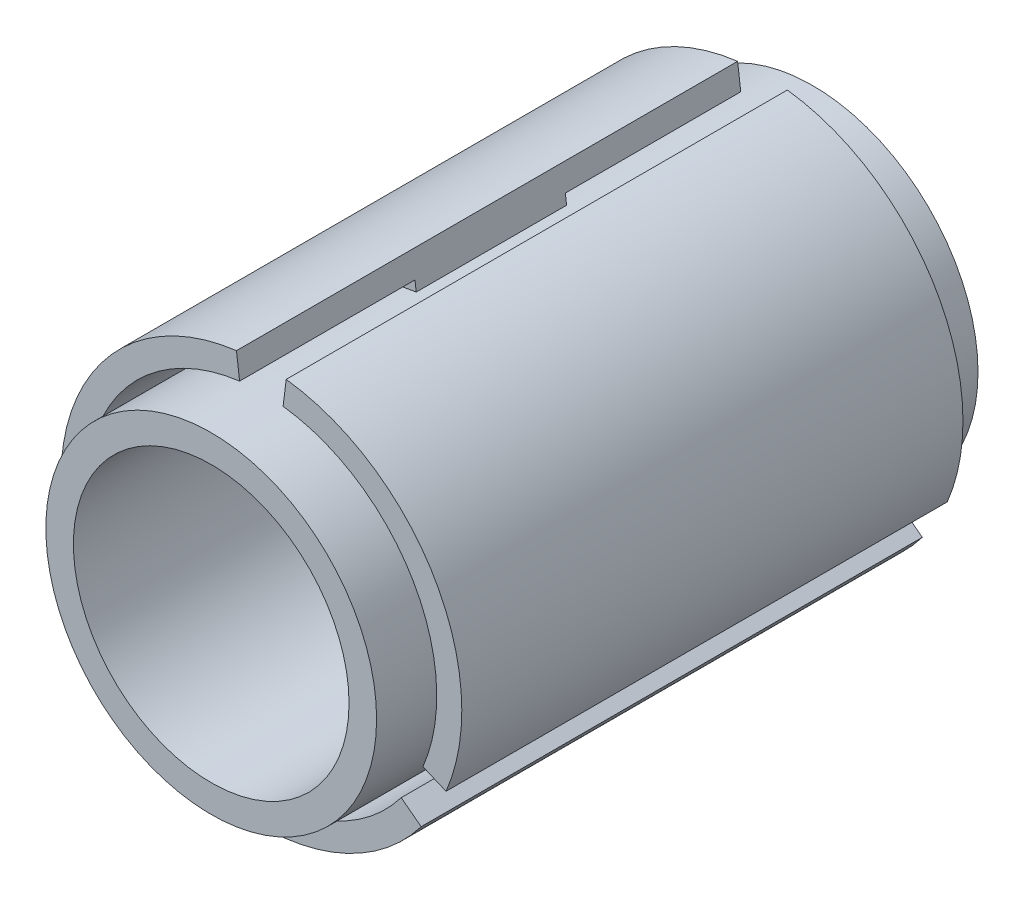
ISO-10303-21;
HEADER;
FILE_DESCRIPTION(('STEP AP214'),'2;1');
FILE_NAME('part.step','',(''),(''),'','','');
FILE_SCHEMA(('AUTOMOTIVE_DESIGN { 1 0 10303 214 1 1 1 1 }'));
ENDSEC;
DATA;
#1=APPLICATION_CONTEXT('core data for automotive mechanical design processes');
#2=APPLICATION_PROTOCOL_DEFINITION('international standard','automotive_design',2000,#1);
#3=PRODUCT_CONTEXT('',#1,'mechanical');
#4=PRODUCT('Part','Part','',(#3));
#5=PRODUCT_RELATED_PRODUCT_CATEGORY('part','',(#4));
#6=PRODUCT_DEFINITION_FORMATION('','',#4);
#7=PRODUCT_DEFINITION_CONTEXT('part definition',#1,'design');
#8=PRODUCT_DEFINITION('design','',#6,#7);
#9=PRODUCT_DEFINITION_SHAPE('','',#8);
#10=(LENGTH_UNIT() NAMED_UNIT(*) SI_UNIT(.MILLI.,.METRE.));
#11=(NAMED_UNIT(*) PLANE_ANGLE_UNIT() SI_UNIT($,.RADIAN.));
#12=(NAMED_UNIT(*) SI_UNIT($,.STERADIAN.) SOLID_ANGLE_UNIT());
#13=UNCERTAINTY_MEASURE_WITH_UNIT(LENGTH_MEASURE(1.E-05),#10,'distance_accuracy_value','');
#14=(GEOMETRIC_REPRESENTATION_CONTEXT(3) GLOBAL_UNCERTAINTY_ASSIGNED_CONTEXT((#13)) GLOBAL_UNIT_ASSIGNED_CONTEXT((#10,
#11,#12)) REPRESENTATION_CONTEXT('',''));
#15=CARTESIAN_POINT('',(0.,0.,0.));
#16=DIRECTION('',(0.,0.,1.));
#17=DIRECTION('',(1.,0.,0.));
#18=AXIS2_PLACEMENT_3D('',#15,#16,#17);
#19=CARTESIAN_POINT('',(0.,0.,15.));
#20=DIRECTION('',(0.,0.,1.));
#21=DIRECTION('',(1.,0.,0.));
#22=AXIS2_PLACEMENT_3D('',#19,#20,#21);
#23=PLANE('',#22);
#24=DIRECTION('',(-0.797320481552713,0.603556169462751,0.));
#25=VECTOR('',#24,1.);
#26=CARTESIAN_POINT('',(31.892819262107,-24.1422467785088,15.));
#27=LINE('',#26,#25);
#28=CARTESIAN_POINT('',(27.906216854345,-21.1244659311962,15.));
#29=VERTEX_POINT('',#28);
#30=CARTESIAN_POINT('',(26.3115758912396,-19.9173535922707,15.));
#31=VERTEX_POINT('',#30);
#32=EDGE_CURVE('E199',#29,#31,#27,.T.);
#33=ORIENTED_EDGE('',*,*,#32,.T.);
#34=CARTESIAN_POINT('',(0.,0.,15.));
#35=DIRECTION('',(0.,0.,1.));
#36=DIRECTION('',(1.,0.,0.));
#37=AXIS2_PLACEMENT_3D('',#34,#35,#36);
#38=CIRCLE('',#37,33.);
#39=CARTESIAN_POINT('',(-26.3115758912396,-19.9173535922707,15.));
#40=VERTEX_POINT('',#39);
#41=EDGE_CURVE('E197',#31,#40,#38,.F.);
#42=ORIENTED_EDGE('',*,*,#41,.T.);
#43=DIRECTION('',(-0.797320481552716,-0.603556169462748,0.));
#44=VECTOR('',#43,1.);
#45=CARTESIAN_POINT('',(-31.892819262107,-24.1422467785088,15.));
#46=LINE('',#45,#44);
#47=CARTESIAN_POINT('',(-27.906216854345,-21.1244659311962,15.));
#48=VERTEX_POINT('',#47);
#49=EDGE_CURVE('E61',#40,#48,#46,.T.);
#50=ORIENTED_EDGE('',*,*,#49,.T.);
#51=CARTESIAN_POINT('',(0.,0.,15.));
#52=DIRECTION('',(0.,0.,1.));
#53=DIRECTION('',(1.,0.,0.));
#54=AXIS2_PLACEMENT_3D('',#51,#52,#53);
#55=CIRCLE('',#54,35.);
#56=EDGE_CURVE('E56',#48,#29,#55,.T.);
#57=ORIENTED_EDGE('',*,*,#56,.T.);
#58=EDGE_LOOP('',(#33,#42,#50,#57));
#59=FACE_BOUND('',#58,.T.);
#60=ADVANCED_FACE('F39',(#59),#23,.T.);
#61=DIRECTION('',(0.921355216141925,0.388721707250915,0.));
#62=VECTOR('',#61,1.);
#63=CARTESIAN_POINT('',(-36.8542086456751,-15.548868290036,15.));
#64=LINE('',#63,#62);
#65=CARTESIAN_POINT('',(-32.2474325649673,-13.6052597537822,15.));
#66=VERTEX_POINT('',#65);
#67=CARTESIAN_POINT('',(-30.4047221326835,-12.8278163392803,15.));
#68=VERTEX_POINT('',#67);
#69=EDGE_CURVE('E252',#66,#68,#64,.T.);
#70=ORIENTED_EDGE('',*,*,#69,.T.);
#71=CARTESIAN_POINT('',(-4.09314624144388,32.745169931551,15.));
#72=VERTEX_POINT('',#71);
#73=EDGE_CURVE('E207',#68,#72,#38,.F.);
#74=ORIENTED_EDGE('',*,*,#73,.T.);
#75=DIRECTION('',(-0.124034734589209,0.992277876713668,0.));
#76=VECTOR('',#75,1.);
#77=CARTESIAN_POINT('',(-4.96138938356809,39.6911150685447,15.));
#78=LINE('',#77,#76);
#79=CARTESIAN_POINT('',(-4.3412157106223,34.7297256849784,15.));
#80=VERTEX_POINT('',#79);
#81=EDGE_CURVE('E255',#72,#80,#78,.T.);
#82=ORIENTED_EDGE('',*,*,#81,.T.);
#83=CARTESIAN_POINT('',(0.,0.,15.));
#84=DIRECTION('',(0.,0.,1.));
#85=DIRECTION('',(1.,0.,0.));
#86=AXIS2_PLACEMENT_3D('',#83,#84,#85);
#87=CIRCLE('',#86,35.);
#88=EDGE_CURVE('E413',#80,#66,#87,.T.);
#89=ORIENTED_EDGE('',*,*,#88,.T.);
#90=EDGE_LOOP('',(#70,#74,#82,#89));
#91=FACE_BOUND('',#90,.T.);
#92=ADVANCED_FACE('F455',(#91),#23,.T.);
#93=CARTESIAN_POINT('',(0.,0.,-15.));
#94=DIRECTION('',(0.,0.,1.));
#95=DIRECTION('',(1.,0.,0.));
#96=AXIS2_PLACEMENT_3D('',#93,#94,#95);
#97=PLANE('',#96);
#98=CARTESIAN_POINT('',(0.,0.,-15.));
#99=DIRECTION('',(0.,0.,1.));
#100=DIRECTION('',(1.,0.,0.));
#101=AXIS2_PLACEMENT_3D('',#98,#99,#100);
#102=CIRCLE('',#101,33.);
#103=CARTESIAN_POINT('',(26.3115758912396,-19.9173535922707,-15.));
#104=VERTEX_POINT('',#103);
#105=CARTESIAN_POINT('',(-26.3115758912396,-19.9173535922707,-15.));
#106=VERTEX_POINT('',#105);
#107=EDGE_CURVE('E204',#104,#106,#102,.F.);
#108=ORIENTED_EDGE('',*,*,#107,.F.);
#109=DIRECTION('',(-0.797320481552713,0.603556169462751,0.));
#110=VECTOR('',#109,1.);
#111=CARTESIAN_POINT('',(31.892819262107,-24.1422467785088,-15.));
#112=LINE('',#111,#110);
#113=CARTESIAN_POINT('',(27.906216854345,-21.1244659311962,-15.));
#114=VERTEX_POINT('',#113);
#115=EDGE_CURVE('E227',#114,#104,#112,.T.);
#116=ORIENTED_EDGE('',*,*,#115,.F.);
#117=CARTESIAN_POINT('',(0.,0.,-15.));
#118=DIRECTION('',(0.,0.,1.));
#119=DIRECTION('',(1.,0.,0.));
#120=AXIS2_PLACEMENT_3D('',#117,#118,#119);
#121=CIRCLE('',#120,35.);
#122=CARTESIAN_POINT('',(-27.906216854345,-21.1244659311962,-15.));
#123=VERTEX_POINT('',#122);
#124=EDGE_CURVE('E331',#123,#114,#121,.T.);
#125=ORIENTED_EDGE('',*,*,#124,.F.);
#126=DIRECTION('',(-0.797320481552716,-0.603556169462748,0.));
#127=VECTOR('',#126,1.);
#128=CARTESIAN_POINT('',(-31.892819262107,-24.1422467785088,-15.));
#129=LINE('',#128,#127);
#130=EDGE_CURVE('E223',#106,#123,#129,.T.);
#131=ORIENTED_EDGE('',*,*,#130,.F.);
#132=EDGE_LOOP('',(#108,#116,#125,#131));
#133=FACE_BOUND('',#132,.T.);
#134=ADVANCED_FACE('F425',(#133),#97,.F.);
#135=CARTESIAN_POINT('',(-30.4047221326835,-12.8278163392803,-15.));
#136=VERTEX_POINT('',#135);
#137=CARTESIAN_POINT('',(-4.09314624144388,32.745169931551,-15.));
#138=VERTEX_POINT('',#137);
#139=EDGE_CURVE('E307',#136,#138,#102,.F.);
#140=ORIENTED_EDGE('',*,*,#139,.F.);
#141=DIRECTION('',(0.921355216141925,0.388721707250915,0.));
#142=VECTOR('',#141,1.);
#143=CARTESIAN_POINT('',(-36.8542086456751,-15.548868290036,-15.));
#144=LINE('',#143,#142);
#145=CARTESIAN_POINT('',(-32.2474325649673,-13.6052597537822,-15.));
#146=VERTEX_POINT('',#145);
#147=EDGE_CURVE('E248',#146,#136,#144,.T.);
#148=ORIENTED_EDGE('',*,*,#147,.F.);
#149=CARTESIAN_POINT('',(0.,0.,-15.));
#150=DIRECTION('',(0.,0.,1.));
#151=DIRECTION('',(1.,0.,0.));
#152=AXIS2_PLACEMENT_3D('',#149,#150,#151);
#153=CIRCLE('',#152,35.);
#154=CARTESIAN_POINT('',(-4.3412157106223,34.7297256849784,-15.));
#155=VERTEX_POINT('',#154);
#156=EDGE_CURVE('E410',#155,#146,#153,.T.);
#157=ORIENTED_EDGE('',*,*,#156,.F.);
#158=DIRECTION('',(-0.124034734589209,0.992277876713668,0.));
#159=VECTOR('',#158,1.);
#160=CARTESIAN_POINT('',(-4.96138938356809,39.6911150685447,-15.));
#161=LINE('',#160,#159);
#162=EDGE_CURVE('E256',#138,#155,#161,.T.);
#163=ORIENTED_EDGE('',*,*,#162,.F.);
#164=EDGE_LOOP('',(#140,#148,#157,#163));
#165=FACE_BOUND('',#164,.T.);
#166=ADVANCED_FACE('F465',(#165),#97,.F.);
#167=DIRECTION('',(-0.124034734589214,-0.992277876713667,0.));
#168=VECTOR('',#167,1.);
#169=CARTESIAN_POINT('',(4.96138938356813,39.6911150685447,15.));
#170=LINE('',#169,#168);
#171=CARTESIAN_POINT('',(4.34121571062233,34.7297256849784,15.));
#172=VERTEX_POINT('',#171);
#173=CARTESIAN_POINT('',(4.09314624144388,32.745169931551,15.));
#174=VERTEX_POINT('',#173);
#175=EDGE_CURVE('E245',#172,#174,#170,.T.);
#176=ORIENTED_EDGE('',*,*,#175,.T.);
#177=CARTESIAN_POINT('',(30.4047221326835,-12.8278163392803,15.));
#178=VERTEX_POINT('',#177);
#179=EDGE_CURVE('E206',#174,#178,#38,.F.);
#180=ORIENTED_EDGE('',*,*,#179,.T.);
#181=DIRECTION('',(0.921355216141923,-0.388721707250919,0.));
#182=VECTOR('',#181,1.);
#183=CARTESIAN_POINT('',(36.8542086456751,-15.548868290036,15.));
#184=LINE('',#183,#182);
#185=CARTESIAN_POINT('',(32.2474325649673,-13.6052597537821,15.));
#186=VERTEX_POINT('',#185);
#187=EDGE_CURVE('E240',#178,#186,#184,.T.);
#188=ORIENTED_EDGE('',*,*,#187,.T.);
#189=CARTESIAN_POINT('',(0.,0.,15.));
#190=DIRECTION('',(0.,0.,1.));
#191=DIRECTION('',(1.,0.,0.));
#192=AXIS2_PLACEMENT_3D('',#189,#190,#191);
#193=CIRCLE('',#192,35.);
#194=EDGE_CURVE('E376',#186,#172,#193,.T.);
#195=ORIENTED_EDGE('',*,*,#194,.T.);
#196=EDGE_LOOP('',(#176,#180,#188,#195));
#197=FACE_BOUND('',#196,.T.);
#198=ADVANCED_FACE('F457',(#197),#23,.T.);
#199=CARTESIAN_POINT('',(4.09314624144388,32.745169931551,-15.));
#200=VERTEX_POINT('',#199);
#201=CARTESIAN_POINT('',(30.4047221326835,-12.8278163392803,-15.));
#202=VERTEX_POINT('',#201);
#203=EDGE_CURVE('E310',#200,#202,#102,.F.);
#204=ORIENTED_EDGE('',*,*,#203,.F.);
#205=DIRECTION('',(-0.124034734589214,-0.992277876713667,0.));
#206=VECTOR('',#205,1.);
#207=CARTESIAN_POINT('',(4.96138938356813,39.6911150685447,-15.));
#208=LINE('',#207,#206);
#209=CARTESIAN_POINT('',(4.34121571062231,34.7297256849784,-15.));
#210=VERTEX_POINT('',#209);
#211=EDGE_CURVE('E244',#210,#200,#208,.T.);
#212=ORIENTED_EDGE('',*,*,#211,.F.);
#213=CARTESIAN_POINT('',(0.,0.,-15.));
#214=DIRECTION('',(0.,0.,1.));
#215=DIRECTION('',(1.,0.,0.));
#216=AXIS2_PLACEMENT_3D('',#213,#214,#215);
#217=CIRCLE('',#216,35.);
#218=CARTESIAN_POINT('',(32.2474325649673,-13.6052597537821,-15.));
#219=VERTEX_POINT('',#218);
#220=EDGE_CURVE('E364',#219,#210,#217,.T.);
#221=ORIENTED_EDGE('',*,*,#220,.F.);
#222=DIRECTION('',(0.921355216141923,-0.388721707250919,0.));
#223=VECTOR('',#222,1.);
#224=CARTESIAN_POINT('',(36.8542086456751,-15.548868290036,-15.));
#225=LINE('',#224,#223);
#226=EDGE_CURVE('E241',#202,#219,#225,.T.);
#227=ORIENTED_EDGE('',*,*,#226,.F.);
#228=EDGE_LOOP('',(#204,#212,#221,#227));
#229=FACE_BOUND('',#228,.T.);
#230=ADVANCED_FACE('F464',(#229),#97,.F.);
#231=CARTESIAN_POINT('',(0.,0.,15.));
#232=DIRECTION('',(0.,0.,-1.));
#233=DIRECTION('',(-1.,0.,0.));
#234=AXIS2_PLACEMENT_3D('',#231,#232,#233);
#235=CYLINDRICAL_SURFACE('',#234,33.);
#236=DIRECTION('',(0.,0.,-1.));
#237=VECTOR('',#236,1.);
#238=CARTESIAN_POINT('',(30.4047221326835,-12.8278163392803,15.));
#239=LINE('',#238,#237);
#240=EDGE_CURVE('E235',#178,#202,#239,.T.);
#241=ORIENTED_EDGE('',*,*,#240,.F.);
#242=ORIENTED_EDGE('',*,*,#179,.F.);
#243=DIRECTION('',(0.,0.,-1.));
#244=VECTOR('',#243,1.);
#245=CARTESIAN_POINT('',(4.09314624144388,32.745169931551,15.));
#246=LINE('',#245,#244);
#247=EDGE_CURVE('E232',#174,#200,#246,.T.);
#248=ORIENTED_EDGE('',*,*,#247,.T.);
#249=ORIENTED_EDGE('',*,*,#203,.T.);
#250=EDGE_LOOP('',(#241,#242,#248,#249));
#251=FACE_BOUND('',#250,.T.);
#252=DIRECTION('',(0.,0.,-1.));
#253=VECTOR('',#252,1.);
#254=CARTESIAN_POINT('',(-26.3115758912396,-19.9173535922707,15.));
#255=LINE('',#254,#253);
#256=EDGE_CURVE('E209',#40,#106,#255,.T.);
#257=ORIENTED_EDGE('',*,*,#256,.F.);
#258=ORIENTED_EDGE('',*,*,#41,.F.);
#259=DIRECTION('',(0.,0.,-1.));
#260=VECTOR('',#259,1.);
#261=CARTESIAN_POINT('',(26.3115758912396,-19.9173535922707,15.));
#262=LINE('',#261,#260);
#263=EDGE_CURVE('E215',#31,#104,#262,.T.);
#264=ORIENTED_EDGE('',*,*,#263,.T.);
#265=ORIENTED_EDGE('',*,*,#107,.T.);
#266=EDGE_LOOP('',(#257,#258,#264,#265));
#267=FACE_BOUND('',#266,.T.);
#268=ORIENTED_EDGE('',*,*,#73,.F.);
#269=DIRECTION('',(0.,0.,-1.));
#270=VECTOR('',#269,1.);
#271=CARTESIAN_POINT('',(-30.4047221326835,-12.8278163392803,15.));
#272=LINE('',#271,#270);
#273=EDGE_CURVE('E48',#68,#136,#272,.T.);
#274=ORIENTED_EDGE('',*,*,#273,.T.);
#275=ORIENTED_EDGE('',*,*,#139,.T.);
#276=DIRECTION('',(0.,0.,-1.));
#277=VECTOR('',#276,1.);
#278=CARTESIAN_POINT('',(-4.09314624144388,32.745169931551,15.));
#279=LINE('',#278,#277);
#280=EDGE_CURVE('E264',#72,#138,#279,.T.);
#281=ORIENTED_EDGE('',*,*,#280,.F.);
#282=EDGE_LOOP('',(#268,#274,#275,#281));
#283=FACE_BOUND('',#282,.T.);
#284=CARTESIAN_POINT('',(0.,0.,-60.));
#285=DIRECTION('',(0.,0.,1.));
#286=DIRECTION('',(1.,0.,0.));
#287=AXIS2_PLACEMENT_3D('',#284,#285,#286);
#288=CIRCLE('',#287,33.);
#289=CARTESIAN_POINT('',(33.,0.,-60.));
#290=VERTEX_POINT('',#289);
#291=EDGE_CURVE('E301',#290,#290,#288,.T.);
#292=ORIENTED_EDGE('',*,*,#291,.T.);
#293=EDGE_LOOP('',(#292));
#294=FACE_BOUND('',#293,.T.);
#295=CARTESIAN_POINT('',(0.,0.,60.));
#296=DIRECTION('',(0.,0.,1.));
#297=DIRECTION('',(1.,0.,0.));
#298=AXIS2_PLACEMENT_3D('',#295,#296,#297);
#299=CIRCLE('',#298,33.);
#300=CARTESIAN_POINT('',(33.,0.,60.));
#301=VERTEX_POINT('',#300);
#302=EDGE_CURVE('E304',#301,#301,#299,.T.);
#303=ORIENTED_EDGE('',*,*,#302,.F.);
#304=EDGE_LOOP('',(#303));
#305=FACE_BOUND('',#304,.T.);
#306=ADVANCED_FACE('F41',(#251,#267,#283,#294,#305),#235,.T.);
#307=CARTESIAN_POINT('',(0.,0.,15.));
#308=DIRECTION('',(0.,0.,-1.));
#309=DIRECTION('',(-1.,0.,0.));
#310=AXIS2_PLACEMENT_3D('',#307,#308,#309);
#311=CYLINDRICAL_SURFACE('',#310,39.999999999998);
#312=DIRECTION('',(0.,0.,-1.));
#313=VECTOR('',#312,1.);
#314=CARTESIAN_POINT('',(-4.96138938356809,39.6911150685447,15.));
#315=LINE('',#314,#313);
#316=CARTESIAN_POINT('',(-4.96138938356809,39.6911150685447,50.));
#317=VERTEX_POINT('',#316);
#318=CARTESIAN_POINT('',(-4.96138938356809,39.6911150685447,-50.));
#319=VERTEX_POINT('',#318);
#320=EDGE_CURVE('E258',#317,#319,#315,.T.);
#321=ORIENTED_EDGE('',*,*,#320,.T.);
#322=CARTESIAN_POINT('',(0.,0.,-50.));
#323=DIRECTION('',(0.,0.,1.));
#324=DIRECTION('',(1.,0.,0.));
#325=AXIS2_PLACEMENT_3D('',#322,#323,#324);
#326=CIRCLE('',#325,39.999999999998);
#327=CARTESIAN_POINT('',(-36.8542086456751,-15.548868290036,-50.));
#328=VERTEX_POINT('',#327);
#329=EDGE_CURVE('E398',#319,#328,#326,.T.);
#330=ORIENTED_EDGE('',*,*,#329,.T.);
#331=DIRECTION('',(0.,0.,-1.));
#332=VECTOR('',#331,1.);
#333=CARTESIAN_POINT('',(-36.8542086456751,-15.548868290036,15.));
#334=LINE('',#333,#332);
#335=CARTESIAN_POINT('',(-36.8542086456751,-15.548868290036,50.));
#336=VERTEX_POINT('',#335);
#337=EDGE_CURVE('E11',#336,#328,#334,.T.);
#338=ORIENTED_EDGE('',*,*,#337,.F.);
#339=CARTESIAN_POINT('',(0.,0.,50.));
#340=DIRECTION('',(0.,0.,1.));
#341=DIRECTION('',(1.,0.,0.));
#342=AXIS2_PLACEMENT_3D('',#339,#340,#341);
#343=CIRCLE('',#342,39.999999999998);
#344=EDGE_CURVE('E387',#317,#336,#343,.T.);
#345=ORIENTED_EDGE('',*,*,#344,.F.);
#346=EDGE_LOOP('',(#321,#330,#338,#345));
#347=FACE_BOUND('',#346,.T.);
#348=ADVANCED_FACE('F511',(#347),#311,.T.);
#349=CARTESIAN_POINT('',(-36.8542086456751,-15.548868290036,15.));
#350=DIRECTION('',(-0.388721707250915,0.921355216141925,0.));
#351=DIRECTION('',(-0.921355216141925,-0.388721707250915,0.));
#352=AXIS2_PLACEMENT_3D('',#349,#350,#351);
#353=PLANE('',#352);
#354=ORIENTED_EDGE('',*,*,#337,.T.);
#355=DIRECTION('',(0.921355216141925,0.388721707250917,0.));
#356=VECTOR('',#355,1.);
#357=CARTESIAN_POINT('',(-36.8542086456751,-15.548868290036,-50.));
#358=LINE('',#357,#356);
#359=CARTESIAN_POINT('',(-32.2474325649673,-13.6052597537822,-50.));
#360=VERTEX_POINT('',#359);
#361=EDGE_CURVE('E384',#328,#360,#358,.T.);
#362=ORIENTED_EDGE('',*,*,#361,.T.);
#363=DIRECTION('',(0.,0.,-1.));
#364=VECTOR('',#363,1.);
#365=CARTESIAN_POINT('',(-32.2474325649673,-13.6052597537822,50.));
#366=LINE('',#365,#364);
#367=EDGE_CURVE('E392',#146,#360,#366,.T.);
#368=ORIENTED_EDGE('',*,*,#367,.F.);
#369=ORIENTED_EDGE('',*,*,#147,.T.);
#370=ORIENTED_EDGE('',*,*,#273,.F.);
#371=ORIENTED_EDGE('',*,*,#69,.F.);
#372=CARTESIAN_POINT('',(-32.2474325649673,-13.6052597537822,50.));
#373=VERTEX_POINT('',#372);
#374=EDGE_CURVE('E403',#373,#66,#366,.T.);
#375=ORIENTED_EDGE('',*,*,#374,.F.);
#376=DIRECTION('',(0.921355216141925,0.388721707250917,0.));
#377=VECTOR('',#376,1.);
#378=CARTESIAN_POINT('',(-36.8542086456751,-15.548868290036,50.));
#379=LINE('',#378,#377);
#380=EDGE_CURVE('E390',#336,#373,#379,.T.);
#381=ORIENTED_EDGE('',*,*,#380,.F.);
#382=EDGE_LOOP('',(#354,#362,#368,#369,#370,#371,#375,#381));
#383=FACE_BOUND('',#382,.T.);
#384=ADVANCED_FACE('F492',(#383),#353,.F.);
#385=CARTESIAN_POINT('',(-4.96138938356809,39.6911150685447,15.));
#386=DIRECTION('',(-0.992277876713668,-0.124034734589209,0.));
#387=DIRECTION('',(0.124034734589209,-0.992277876713668,0.));
#388=AXIS2_PLACEMENT_3D('',#385,#386,#387);
#389=PLANE('',#388);
#390=ORIENTED_EDGE('',*,*,#320,.F.);
#391=DIRECTION('',(-0.124034734589209,0.992277876713668,0.));
#392=VECTOR('',#391,1.);
#393=CARTESIAN_POINT('',(-4.3412157106223,34.7297256849784,50.));
#394=LINE('',#393,#392);
#395=CARTESIAN_POINT('',(-4.3412157106223,34.7297256849784,50.));
#396=VERTEX_POINT('',#395);
#397=EDGE_CURVE('E383',#396,#317,#394,.T.);
#398=ORIENTED_EDGE('',*,*,#397,.F.);
#399=DIRECTION('',(0.,0.,-1.));
#400=VECTOR('',#399,1.);
#401=CARTESIAN_POINT('',(-4.3412157106223,34.7297256849784,50.));
#402=LINE('',#401,#400);
#403=EDGE_CURVE('E407',#396,#80,#402,.T.);
#404=ORIENTED_EDGE('',*,*,#403,.T.);
#405=ORIENTED_EDGE('',*,*,#81,.F.);
#406=ORIENTED_EDGE('',*,*,#280,.T.);
#407=ORIENTED_EDGE('',*,*,#162,.T.);
#408=CARTESIAN_POINT('',(-4.3412157106223,34.7297256849784,-50.));
#409=VERTEX_POINT('',#408);
#410=EDGE_CURVE('E406',#155,#409,#402,.T.);
#411=ORIENTED_EDGE('',*,*,#410,.T.);
#412=DIRECTION('',(-0.124034734589209,0.992277876713668,0.));
#413=VECTOR('',#412,1.);
#414=CARTESIAN_POINT('',(-4.3412157106223,34.7297256849784,-50.));
#415=LINE('',#414,#413);
#416=EDGE_CURVE('E395',#409,#319,#415,.T.);
#417=ORIENTED_EDGE('',*,*,#416,.T.);
#418=EDGE_LOOP('',(#390,#398,#404,#405,#406,#407,#411,#417));
#419=FACE_BOUND('',#418,.T.);
#420=ADVANCED_FACE('F498',(#419),#389,.F.);
#421=CARTESIAN_POINT('',(0.,0.,15.));
#422=DIRECTION('',(0.,0.,-1.));
#423=DIRECTION('',(-1.,0.,0.));
#424=AXIS2_PLACEMENT_3D('',#421,#422,#423);
#425=CYLINDRICAL_SURFACE('',#424,39.999999999998);
#426=DIRECTION('',(0.,0.,-1.));
#427=VECTOR('',#426,1.);
#428=CARTESIAN_POINT('',(36.8542086456751,-15.548868290036,15.));
#429=LINE('',#428,#427);
#430=CARTESIAN_POINT('',(36.8542086456751,-15.548868290036,50.));
#431=VERTEX_POINT('',#430);
#432=CARTESIAN_POINT('',(36.8542086456751,-15.548868290036,-50.));
#433=VERTEX_POINT('',#432);
#434=EDGE_CURVE('E238',#431,#433,#429,.T.);
#435=ORIENTED_EDGE('',*,*,#434,.T.);
#436=CARTESIAN_POINT('',(0.,0.,-50.));
#437=DIRECTION('',(0.,0.,1.));
#438=DIRECTION('',(1.,0.,0.));
#439=AXIS2_PLACEMENT_3D('',#436,#437,#438);
#440=CIRCLE('',#439,39.999999999998);
#441=CARTESIAN_POINT('',(4.96138938356813,39.6911150685447,-50.));
#442=VERTEX_POINT('',#441);
#443=EDGE_CURVE('E354',#433,#442,#440,.T.);
#444=ORIENTED_EDGE('',*,*,#443,.T.);
#445=DIRECTION('',(0.,0.,-1.));
#446=VECTOR('',#445,1.);
#447=CARTESIAN_POINT('',(4.96138938356813,39.6911150685447,15.));
#448=LINE('',#447,#446);
#449=CARTESIAN_POINT('',(4.96138938356813,39.6911150685447,50.));
#450=VERTEX_POINT('',#449);
#451=EDGE_CURVE('E230',#450,#442,#448,.T.);
#452=ORIENTED_EDGE('',*,*,#451,.F.);
#453=CARTESIAN_POINT('',(0.,0.,50.));
#454=DIRECTION('',(0.,0.,1.));
#455=DIRECTION('',(1.,0.,0.));
#456=AXIS2_PLACEMENT_3D('',#453,#454,#455);
#457=CIRCLE('',#456,39.999999999998);
#458=EDGE_CURVE('E366',#431,#450,#457,.T.);
#459=ORIENTED_EDGE('',*,*,#458,.F.);
#460=EDGE_LOOP('',(#435,#444,#452,#459));
#461=FACE_BOUND('',#460,.T.);
#462=ADVANCED_FACE('F532',(#461),#425,.T.);
#463=CARTESIAN_POINT('',(4.96138938356813,39.6911150685447,15.));
#464=DIRECTION('',(0.992277876713667,-0.124034734589214,0.));
#465=DIRECTION('',(0.124034734589214,0.992277876713667,0.));
#466=AXIS2_PLACEMENT_3D('',#463,#464,#465);
#467=PLANE('',#466);
#468=ORIENTED_EDGE('',*,*,#451,.T.);
#469=DIRECTION('',(-0.124034734589209,-0.992277876713668,0.));
#470=VECTOR('',#469,1.);
#471=CARTESIAN_POINT('',(4.34121571062233,34.7297256849784,-50.));
#472=LINE('',#471,#470);
#473=CARTESIAN_POINT('',(4.34121571062233,34.7297256849784,-50.));
#474=VERTEX_POINT('',#473);
#475=EDGE_CURVE('E351',#442,#474,#472,.T.);
#476=ORIENTED_EDGE('',*,*,#475,.T.);
#477=DIRECTION('',(0.,0.,-1.));
#478=VECTOR('',#477,1.);
#479=CARTESIAN_POINT('',(4.34121571062233,34.7297256849784,50.));
#480=LINE('',#479,#478);
#481=EDGE_CURVE('E346',#210,#474,#480,.T.);
#482=ORIENTED_EDGE('',*,*,#481,.F.);
#483=ORIENTED_EDGE('',*,*,#211,.T.);
#484=ORIENTED_EDGE('',*,*,#247,.F.);
#485=ORIENTED_EDGE('',*,*,#175,.F.);
#486=CARTESIAN_POINT('',(4.34121571062233,34.7297256849784,50.));
#487=VERTEX_POINT('',#486);
#488=EDGE_CURVE('E347',#487,#172,#480,.T.);
#489=ORIENTED_EDGE('',*,*,#488,.F.);
#490=DIRECTION('',(-0.124034734589209,-0.992277876713668,0.));
#491=VECTOR('',#490,1.);
#492=CARTESIAN_POINT('',(4.34121571062233,34.7297256849784,50.));
#493=LINE('',#492,#491);
#494=EDGE_CURVE('E350',#450,#487,#493,.T.);
#495=ORIENTED_EDGE('',*,*,#494,.F.);
#496=EDGE_LOOP('',(#468,#476,#482,#483,#484,#485,#489,#495));
#497=FACE_BOUND('',#496,.T.);
#498=ADVANCED_FACE('F478',(#497),#467,.F.);
#499=CARTESIAN_POINT('',(36.8542086456751,-15.548868290036,15.));
#500=DIRECTION('',(0.38872170725092,0.921355216141923,0.));
#501=DIRECTION('',(-0.921355216141923,0.38872170725092,0.));
#502=AXIS2_PLACEMENT_3D('',#499,#500,#501);
#503=PLANE('',#502);
#504=ORIENTED_EDGE('',*,*,#434,.F.);
#505=DIRECTION('',(0.921355216141923,-0.388721707250919,0.));
#506=VECTOR('',#505,1.);
#507=CARTESIAN_POINT('',(32.2474325649673,-13.6052597537821,50.));
#508=LINE('',#507,#506);
#509=CARTESIAN_POINT('',(32.2474325649673,-13.6052597537821,50.));
#510=VERTEX_POINT('',#509);
#511=EDGE_CURVE('E369',#510,#431,#508,.T.);
#512=ORIENTED_EDGE('',*,*,#511,.F.);
#513=DIRECTION('',(0.,0.,-1.));
#514=VECTOR('',#513,1.);
#515=CARTESIAN_POINT('',(32.2474325649673,-13.6052597537821,50.));
#516=LINE('',#515,#514);
#517=EDGE_CURVE('E343',#510,#186,#516,.T.);
#518=ORIENTED_EDGE('',*,*,#517,.T.);
#519=ORIENTED_EDGE('',*,*,#187,.F.);
#520=ORIENTED_EDGE('',*,*,#240,.T.);
#521=ORIENTED_EDGE('',*,*,#226,.T.);
#522=CARTESIAN_POINT('',(32.2474325649673,-13.6052597537821,-50.));
#523=VERTEX_POINT('',#522);
#524=EDGE_CURVE('E342',#219,#523,#516,.T.);
#525=ORIENTED_EDGE('',*,*,#524,.T.);
#526=DIRECTION('',(0.921355216141923,-0.388721707250919,0.));
#527=VECTOR('',#526,1.);
#528=CARTESIAN_POINT('',(32.2474325649673,-13.6052597537821,-50.));
#529=LINE('',#528,#527);
#530=EDGE_CURVE('E358',#523,#433,#529,.T.);
#531=ORIENTED_EDGE('',*,*,#530,.T.);
#532=EDGE_LOOP('',(#504,#512,#518,#519,#520,#521,#525,#531));
#533=FACE_BOUND('',#532,.T.);
#534=ADVANCED_FACE('F529',(#533),#503,.F.);
#535=CARTESIAN_POINT('',(0.,0.,15.));
#536=DIRECTION('',(0.,0.,-1.));
#537=DIRECTION('',(-1.,0.,0.));
#538=AXIS2_PLACEMENT_3D('',#535,#536,#537);
#539=CYLINDRICAL_SURFACE('',#538,39.999999999998);
#540=DIRECTION('',(0.,0.,-1.));
#541=VECTOR('',#540,1.);
#542=CARTESIAN_POINT('',(-31.892819262107,-24.1422467785088,15.));
#543=LINE('',#542,#541);
#544=CARTESIAN_POINT('',(-31.892819262107,-24.1422467785088,50.));
#545=VERTEX_POINT('',#544);
#546=CARTESIAN_POINT('',(-31.892819262107,-24.1422467785088,-50.));
#547=VERTEX_POINT('',#546);
#548=EDGE_CURVE('E214',#545,#547,#543,.T.);
#549=ORIENTED_EDGE('',*,*,#548,.T.);
#550=CARTESIAN_POINT('',(0.,0.,-50.));
#551=DIRECTION('',(0.,0.,1.));
#552=DIRECTION('',(1.,0.,0.));
#553=AXIS2_PLACEMENT_3D('',#550,#551,#552);
#554=CIRCLE('',#553,39.999999999998);
#555=CARTESIAN_POINT('',(31.892819262107,-24.1422467785088,-50.));
#556=VERTEX_POINT('',#555);
#557=EDGE_CURVE('E328',#547,#556,#554,.T.);
#558=ORIENTED_EDGE('',*,*,#557,.T.);
#559=DIRECTION('',(0.,0.,-1.));
#560=VECTOR('',#559,1.);
#561=CARTESIAN_POINT('',(31.892819262107,-24.1422467785088,15.));
#562=LINE('',#561,#560);
#563=CARTESIAN_POINT('',(31.892819262107,-24.1422467785088,50.));
#564=VERTEX_POINT('',#563);
#565=EDGE_CURVE('E416',#564,#556,#562,.T.);
#566=ORIENTED_EDGE('',*,*,#565,.F.);
#567=CARTESIAN_POINT('',(0.,0.,50.));
#568=DIRECTION('',(0.,0.,1.));
#569=DIRECTION('',(1.,0.,0.));
#570=AXIS2_PLACEMENT_3D('',#567,#568,#569);
#571=CIRCLE('',#570,39.999999999998);
#572=EDGE_CURVE('E322',#545,#564,#571,.T.);
#573=ORIENTED_EDGE('',*,*,#572,.F.);
#574=EDGE_LOOP('',(#549,#558,#566,#573));
#575=FACE_BOUND('',#574,.T.);
#576=ADVANCED_FACE('F435',(#575),#539,.T.);
#577=CARTESIAN_POINT('',(31.892819262107,-24.1422467785088,15.));
#578=DIRECTION('',(-0.603556169462751,-0.797320481552713,0.));
#579=DIRECTION('',(0.797320481552713,-0.603556169462751,0.));
#580=AXIS2_PLACEMENT_3D('',#577,#578,#579);
#581=PLANE('',#580);
#582=ORIENTED_EDGE('',*,*,#565,.T.);
#583=DIRECTION('',(-0.797320481552713,0.603556169462752,0.));
#584=VECTOR('',#583,1.);
#585=CARTESIAN_POINT('',(31.892819262107,-24.1422467785088,-50.));
#586=LINE('',#585,#584);
#587=CARTESIAN_POINT('',(27.906216854345,-21.1244659311962,-50.));
#588=VERTEX_POINT('',#587);
#589=EDGE_CURVE('E325',#556,#588,#586,.T.);
#590=ORIENTED_EDGE('',*,*,#589,.T.);
#591=DIRECTION('',(0.,0.,-1.));
#592=VECTOR('',#591,1.);
#593=CARTESIAN_POINT('',(27.906216854345,-21.1244659311962,50.));
#594=LINE('',#593,#592);
#595=EDGE_CURVE('E203',#114,#588,#594,.T.);
#596=ORIENTED_EDGE('',*,*,#595,.F.);
#597=ORIENTED_EDGE('',*,*,#115,.T.);
#598=ORIENTED_EDGE('',*,*,#263,.F.);
#599=ORIENTED_EDGE('',*,*,#32,.F.);
#600=CARTESIAN_POINT('',(27.906216854345,-21.1244659311962,50.));
#601=VERTEX_POINT('',#600);
#602=EDGE_CURVE('E312',#601,#29,#594,.T.);
#603=ORIENTED_EDGE('',*,*,#602,.F.);
#604=DIRECTION('',(-0.797320481552713,0.603556169462752,0.));
#605=VECTOR('',#604,1.);
#606=CARTESIAN_POINT('',(31.892819262107,-24.1422467785088,50.));
#607=LINE('',#606,#605);
#608=EDGE_CURVE('E336',#564,#601,#607,.T.);
#609=ORIENTED_EDGE('',*,*,#608,.F.);
#610=EDGE_LOOP('',(#582,#590,#596,#597,#598,#599,#603,#609));
#611=FACE_BOUND('',#610,.T.);
#612=ADVANCED_FACE('F422',(#611),#581,.F.);
#613=CARTESIAN_POINT('',(-31.892819262107,-24.1422467785088,15.));
#614=DIRECTION('',(0.603556169462748,-0.797320481552716,0.));
#615=DIRECTION('',(0.797320481552716,0.603556169462748,0.));
#616=AXIS2_PLACEMENT_3D('',#613,#614,#615);
#617=PLANE('',#616);
#618=ORIENTED_EDGE('',*,*,#548,.F.);
#619=DIRECTION('',(-0.797320481552715,-0.603556169462749,0.));
#620=VECTOR('',#619,1.);
#621=CARTESIAN_POINT('',(-31.892819262107,-24.1422467785088,50.));
#622=LINE('',#621,#620);
#623=CARTESIAN_POINT('',(-27.906216854345,-21.1244659311962,50.));
#624=VERTEX_POINT('',#623);
#625=EDGE_CURVE('E317',#624,#545,#622,.T.);
#626=ORIENTED_EDGE('',*,*,#625,.F.);
#627=DIRECTION('',(0.,0.,-1.));
#628=VECTOR('',#627,1.);
#629=CARTESIAN_POINT('',(-27.906216854345,-21.1244659311962,50.));
#630=LINE('',#629,#628);
#631=EDGE_CURVE('E221',#624,#48,#630,.T.);
#632=ORIENTED_EDGE('',*,*,#631,.T.);
#633=ORIENTED_EDGE('',*,*,#49,.F.);
#634=ORIENTED_EDGE('',*,*,#256,.T.);
#635=ORIENTED_EDGE('',*,*,#130,.T.);
#636=CARTESIAN_POINT('',(-27.906216854345,-21.1244659311962,-50.));
#637=VERTEX_POINT('',#636);
#638=EDGE_CURVE('E315',#123,#637,#630,.T.);
#639=ORIENTED_EDGE('',*,*,#638,.T.);
#640=DIRECTION('',(-0.797320481552715,-0.603556169462749,0.));
#641=VECTOR('',#640,1.);
#642=CARTESIAN_POINT('',(-31.892819262107,-24.1422467785088,-50.));
#643=LINE('',#642,#641);
#644=EDGE_CURVE('E318',#637,#547,#643,.T.);
#645=ORIENTED_EDGE('',*,*,#644,.T.);
#646=EDGE_LOOP('',(#618,#626,#632,#633,#634,#635,#639,#645));
#647=FACE_BOUND('',#646,.T.);
#648=ADVANCED_FACE('F218',(#647),#617,.F.);
#649=CARTESIAN_POINT('',(0.,0.,-50.));
#650=DIRECTION('',(0.,0.,1.));
#651=DIRECTION('',(1.,0.,0.));
#652=AXIS2_PLACEMENT_3D('',#649,#650,#651);
#653=PLANE('',#652);
#654=CARTESIAN_POINT('',(0.,0.,-50.));
#655=DIRECTION('',(0.,0.,-1.));
#656=DIRECTION('',(1.,0.,0.));
#657=AXIS2_PLACEMENT_3D('',#654,#655,#656);
#658=CIRCLE('',#657,35.);
#659=EDGE_CURVE('E379',#360,#409,#658,.T.);
#660=ORIENTED_EDGE('',*,*,#659,.F.);
#661=ORIENTED_EDGE('',*,*,#361,.F.);
#662=ORIENTED_EDGE('',*,*,#329,.F.);
#663=ORIENTED_EDGE('',*,*,#416,.F.);
#664=EDGE_LOOP('',(#660,#661,#662,#663));
#665=FACE_BOUND('',#664,.T.);
#666=ADVANCED_FACE('F514',(#665),#653,.F.);
#667=CARTESIAN_POINT('',(0.,0.,50.));
#668=DIRECTION('',(0.,0.,-1.));
#669=DIRECTION('',(-1.,0.,0.));
#670=AXIS2_PLACEMENT_3D('',#667,#668,#669);
#671=CYLINDRICAL_SURFACE('',#670,35.);
#672=ORIENTED_EDGE('',*,*,#410,.F.);
#673=ORIENTED_EDGE('',*,*,#156,.T.);
#674=ORIENTED_EDGE('',*,*,#367,.T.);
#675=ORIENTED_EDGE('',*,*,#659,.T.);
#676=EDGE_LOOP('',(#672,#673,#674,#675));
#677=FACE_BOUND('',#676,.T.);
#678=ADVANCED_FACE('F496',(#677),#671,.F.);
#679=ORIENTED_EDGE('',*,*,#88,.F.);
#680=ORIENTED_EDGE('',*,*,#403,.F.);
#681=CARTESIAN_POINT('',(0.,0.,50.));
#682=DIRECTION('',(0.,0.,-1.));
#683=DIRECTION('',(1.,0.,0.));
#684=AXIS2_PLACEMENT_3D('',#681,#682,#683);
#685=CIRCLE('',#684,35.);
#686=EDGE_CURVE('E380',#373,#396,#685,.T.);
#687=ORIENTED_EDGE('',*,*,#686,.F.);
#688=ORIENTED_EDGE('',*,*,#374,.T.);
#689=EDGE_LOOP('',(#679,#680,#687,#688));
#690=FACE_BOUND('',#689,.T.);
#691=ADVANCED_FACE('F503',(#690),#671,.F.);
#692=CARTESIAN_POINT('',(0.,0.,50.));
#693=DIRECTION('',(0.,0.,1.));
#694=DIRECTION('',(1.,0.,0.));
#695=AXIS2_PLACEMENT_3D('',#692,#693,#694);
#696=PLANE('',#695);
#697=ORIENTED_EDGE('',*,*,#686,.T.);
#698=ORIENTED_EDGE('',*,*,#397,.T.);
#699=ORIENTED_EDGE('',*,*,#344,.T.);
#700=ORIENTED_EDGE('',*,*,#380,.T.);
#701=EDGE_LOOP('',(#697,#698,#699,#700));
#702=FACE_BOUND('',#701,.T.);
#703=ADVANCED_FACE('F508',(#702),#696,.T.);
#704=CARTESIAN_POINT('',(0.,0.,-50.));
#705=DIRECTION('',(0.,0.,1.));
#706=DIRECTION('',(1.,0.,0.));
#707=AXIS2_PLACEMENT_3D('',#704,#705,#706);
#708=PLANE('',#707);
#709=CARTESIAN_POINT('',(0.,0.,-50.));
#710=DIRECTION('',(0.,0.,-1.));
#711=DIRECTION('',(1.,0.,0.));
#712=AXIS2_PLACEMENT_3D('',#709,#710,#711);
#713=CIRCLE('',#712,35.);
#714=EDGE_CURVE('E361',#474,#523,#713,.T.);
#715=ORIENTED_EDGE('',*,*,#714,.F.);
#716=ORIENTED_EDGE('',*,*,#475,.F.);
#717=ORIENTED_EDGE('',*,*,#443,.F.);
#718=ORIENTED_EDGE('',*,*,#530,.F.);
#719=EDGE_LOOP('',(#715,#716,#717,#718));
#720=FACE_BOUND('',#719,.T.);
#721=ADVANCED_FACE('F752',(#720),#708,.F.);
#722=CARTESIAN_POINT('',(0.,0.,50.));
#723=DIRECTION('',(0.,0.,-1.));
#724=DIRECTION('',(-1.,0.,0.));
#725=AXIS2_PLACEMENT_3D('',#722,#723,#724);
#726=CYLINDRICAL_SURFACE('',#725,35.);
#727=ORIENTED_EDGE('',*,*,#524,.F.);
#728=ORIENTED_EDGE('',*,*,#220,.T.);
#729=ORIENTED_EDGE('',*,*,#481,.T.);
#730=ORIENTED_EDGE('',*,*,#714,.T.);
#731=EDGE_LOOP('',(#727,#728,#729,#730));
#732=FACE_BOUND('',#731,.T.);
#733=ADVANCED_FACE('F743',(#732),#726,.F.);
#734=ORIENTED_EDGE('',*,*,#194,.F.);
#735=ORIENTED_EDGE('',*,*,#517,.F.);
#736=CARTESIAN_POINT('',(0.,0.,50.));
#737=DIRECTION('',(0.,0.,-1.));
#738=DIRECTION('',(1.,0.,0.));
#739=AXIS2_PLACEMENT_3D('',#736,#737,#738);
#740=CIRCLE('',#739,35.);
#741=EDGE_CURVE('E355',#487,#510,#740,.T.);
#742=ORIENTED_EDGE('',*,*,#741,.F.);
#743=ORIENTED_EDGE('',*,*,#488,.T.);
#744=EDGE_LOOP('',(#734,#735,#742,#743));
#745=FACE_BOUND('',#744,.T.);
#746=ADVANCED_FACE('F735',(#745),#726,.F.);
#747=CARTESIAN_POINT('',(0.,0.,50.));
#748=DIRECTION('',(0.,0.,1.));
#749=DIRECTION('',(1.,0.,0.));
#750=AXIS2_PLACEMENT_3D('',#747,#748,#749);
#751=PLANE('',#750);
#752=ORIENTED_EDGE('',*,*,#741,.T.);
#753=ORIENTED_EDGE('',*,*,#511,.T.);
#754=ORIENTED_EDGE('',*,*,#458,.T.);
#755=ORIENTED_EDGE('',*,*,#494,.T.);
#756=EDGE_LOOP('',(#752,#753,#754,#755));
#757=FACE_BOUND('',#756,.T.);
#758=ADVANCED_FACE('F728',(#757),#751,.T.);
#759=CARTESIAN_POINT('',(0.,0.,-50.));
#760=DIRECTION('',(0.,0.,1.));
#761=DIRECTION('',(1.,0.,0.));
#762=AXIS2_PLACEMENT_3D('',#759,#760,#761);
#763=PLANE('',#762);
#764=ORIENTED_EDGE('',*,*,#557,.F.);
#765=ORIENTED_EDGE('',*,*,#644,.F.);
#766=CARTESIAN_POINT('',(0.,0.,-50.));
#767=DIRECTION('',(0.,0.,-1.));
#768=DIRECTION('',(1.,0.,0.));
#769=AXIS2_PLACEMENT_3D('',#766,#767,#768);
#770=CIRCLE('',#769,35.);
#771=EDGE_CURVE('E321',#588,#637,#770,.T.);
#772=ORIENTED_EDGE('',*,*,#771,.F.);
#773=ORIENTED_EDGE('',*,*,#589,.F.);
#774=EDGE_LOOP('',(#764,#765,#772,#773));
#775=FACE_BOUND('',#774,.T.);
#776=ADVANCED_FACE('F433',(#775),#763,.F.);
#777=CARTESIAN_POINT('',(0.,0.,50.));
#778=DIRECTION('',(0.,0.,-1.));
#779=DIRECTION('',(-1.,0.,0.));
#780=AXIS2_PLACEMENT_3D('',#777,#778,#779);
#781=CYLINDRICAL_SURFACE('',#780,35.);
#782=ORIENTED_EDGE('',*,*,#638,.F.);
#783=ORIENTED_EDGE('',*,*,#124,.T.);
#784=ORIENTED_EDGE('',*,*,#595,.T.);
#785=ORIENTED_EDGE('',*,*,#771,.T.);
#786=EDGE_LOOP('',(#782,#783,#784,#785));
#787=FACE_BOUND('',#786,.T.);
#788=ADVANCED_FACE('F427',(#787),#781,.F.);
#789=ORIENTED_EDGE('',*,*,#56,.F.);
#790=ORIENTED_EDGE('',*,*,#631,.F.);
#791=CARTESIAN_POINT('',(0.,0.,50.));
#792=DIRECTION('',(0.,0.,-1.));
#793=DIRECTION('',(1.,0.,0.));
#794=AXIS2_PLACEMENT_3D('',#791,#792,#793);
#795=CIRCLE('',#794,35.);
#796=EDGE_CURVE('E334',#601,#624,#795,.T.);
#797=ORIENTED_EDGE('',*,*,#796,.F.);
#798=ORIENTED_EDGE('',*,*,#602,.T.);
#799=EDGE_LOOP('',(#789,#790,#797,#798));
#800=FACE_BOUND('',#799,.T.);
#801=ADVANCED_FACE('F443',(#800),#781,.F.);
#802=CARTESIAN_POINT('',(0.,0.,50.));
#803=DIRECTION('',(0.,0.,1.));
#804=DIRECTION('',(1.,0.,0.));
#805=AXIS2_PLACEMENT_3D('',#802,#803,#804);
#806=PLANE('',#805);
#807=ORIENTED_EDGE('',*,*,#572,.T.);
#808=ORIENTED_EDGE('',*,*,#608,.T.);
#809=ORIENTED_EDGE('',*,*,#796,.T.);
#810=ORIENTED_EDGE('',*,*,#625,.T.);
#811=EDGE_LOOP('',(#807,#808,#809,#810));
#812=FACE_BOUND('',#811,.T.);
#813=ADVANCED_FACE('F439',(#812),#806,.T.);
#814=CARTESIAN_POINT('',(0.,0.,-60.));
#815=DIRECTION('',(0.,0.,1.));
#816=DIRECTION('',(1.,0.,0.));
#817=AXIS2_PLACEMENT_3D('',#814,#815,#816);
#818=PLANE('',#817);
#819=CARTESIAN_POINT('',(0.,0.,-60.));
#820=DIRECTION('',(0.,0.,-1.));
#821=DIRECTION('',(-1.,0.,0.));
#822=AXIS2_PLACEMENT_3D('',#819,#820,#821);
#823=CIRCLE('',#822,27.5);
#824=CARTESIAN_POINT('',(-27.5,0.,-60.));
#825=VERTEX_POINT('',#824);
#826=EDGE_CURVE('E291',#825,#825,#823,.T.);
#827=ORIENTED_EDGE('',*,*,#826,.F.);
#828=EDGE_LOOP('',(#827));
#829=FACE_BOUND('',#828,.T.);
#830=ORIENTED_EDGE('',*,*,#291,.F.);
#831=EDGE_LOOP('',(#830));
#832=FACE_BOUND('',#831,.T.);
#833=ADVANCED_FACE('F450',(#829,#832),#818,.F.);
#834=CARTESIAN_POINT('',(0.,0.,60.));
#835=DIRECTION('',(0.,0.,1.));
#836=DIRECTION('',(1.,0.,0.));
#837=AXIS2_PLACEMENT_3D('',#834,#835,#836);
#838=PLANE('',#837);
#839=CARTESIAN_POINT('',(0.,0.,60.));
#840=DIRECTION('',(0.,0.,1.));
#841=DIRECTION('',(1.,0.,0.));
#842=AXIS2_PLACEMENT_3D('',#839,#840,#841);
#843=CIRCLE('',#842,27.5);
#844=CARTESIAN_POINT('',(27.5,0.,60.));
#845=VERTEX_POINT('',#844);
#846=EDGE_CURVE('E295',#845,#845,#843,.T.);
#847=ORIENTED_EDGE('',*,*,#846,.F.);
#848=EDGE_LOOP('',(#847));
#849=FACE_BOUND('',#848,.T.);
#850=ORIENTED_EDGE('',*,*,#302,.T.);
#851=EDGE_LOOP('',(#850));
#852=FACE_BOUND('',#851,.T.);
#853=ADVANCED_FACE('F590',(#849,#852),#838,.T.);
#854=CARTESIAN_POINT('',(0.,0.,20.));
#855=DIRECTION('',(0.,0.,1.));
#856=DIRECTION('',(1.,0.,0.));
#857=AXIS2_PLACEMENT_3D('',#854,#855,#856);
#858=CYLINDRICAL_SURFACE('',#857,27.5);
#859=CARTESIAN_POINT('',(0.,0.,20.));
#860=DIRECTION('',(0.,0.,1.));
#861=DIRECTION('',(1.,0.,0.));
#862=AXIS2_PLACEMENT_3D('',#859,#860,#861);
#863=CIRCLE('',#862,27.5);
#864=CARTESIAN_POINT('',(27.5,0.,20.));
#865=VERTEX_POINT('',#864);
#866=EDGE_CURVE('E298',#865,#865,#863,.T.);
#867=ORIENTED_EDGE('',*,*,#866,.F.);
#868=EDGE_LOOP('',(#867));
#869=FACE_BOUND('',#868,.T.);
#870=ORIENTED_EDGE('',*,*,#846,.T.);
#871=EDGE_LOOP('',(#870));
#872=FACE_BOUND('',#871,.T.);
#873=ADVANCED_FACE('F594',(#869,#872),#858,.F.);
#874=CARTESIAN_POINT('',(0.,0.,20.));
#875=DIRECTION('',(0.,0.,1.));
#876=DIRECTION('',(1.,0.,0.));
#877=AXIS2_PLACEMENT_3D('',#874,#875,#876);
#878=PLANE('',#877);
#879=CARTESIAN_POINT('',(5.,-5.,20.));
#880=DIRECTION('',(0.,0.,1.));
#881=DIRECTION('',(1.,0.,0.));
#882=AXIS2_PLACEMENT_3D('',#879,#880,#881);
#883=CIRCLE('',#882,1.);
#884=CARTESIAN_POINT('',(6.,-5.,20.));
#885=VERTEX_POINT('',#884);
#886=EDGE_CURVE('E288',#885,#885,#883,.T.);
#887=ORIENTED_EDGE('',*,*,#886,.F.);
#888=EDGE_LOOP('',(#887));
#889=FACE_BOUND('',#888,.T.);
#890=CARTESIAN_POINT('',(-5.,-5.,20.));
#891=DIRECTION('',(0.,0.,1.));
#892=DIRECTION('',(1.,0.,0.));
#893=AXIS2_PLACEMENT_3D('',#890,#891,#892);
#894=CIRCLE('',#893,1.);
#895=CARTESIAN_POINT('',(-4.,-5.,20.));
#896=VERTEX_POINT('',#895);
#897=EDGE_CURVE('E277',#896,#896,#894,.T.);
#898=ORIENTED_EDGE('',*,*,#897,.F.);
#899=EDGE_LOOP('',(#898));
#900=FACE_BOUND('',#899,.T.);
#901=CARTESIAN_POINT('',(-5.,5.,20.));
#902=DIRECTION('',(0.,0.,1.));
#903=DIRECTION('',(1.,0.,0.));
#904=AXIS2_PLACEMENT_3D('',#901,#902,#903);
#905=CIRCLE('',#904,1.);
#906=CARTESIAN_POINT('',(-4.,5.,20.));
#907=VERTEX_POINT('',#906);
#908=EDGE_CURVE('E274',#907,#907,#905,.T.);
#909=ORIENTED_EDGE('',*,*,#908,.F.);
#910=EDGE_LOOP('',(#909));
#911=FACE_BOUND('',#910,.T.);
#912=CARTESIAN_POINT('',(5.,5.,20.));
#913=DIRECTION('',(0.,0.,1.));
#914=DIRECTION('',(1.,0.,0.));
#915=AXIS2_PLACEMENT_3D('',#912,#913,#914);
#916=CIRCLE('',#915,1.);
#917=CARTESIAN_POINT('',(6.,5.,20.));
#918=VERTEX_POINT('',#917);
#919=EDGE_CURVE('E271',#918,#918,#916,.T.);
#920=ORIENTED_EDGE('',*,*,#919,.F.);
#921=EDGE_LOOP('',(#920));
#922=FACE_BOUND('',#921,.T.);
#923=ORIENTED_EDGE('',*,*,#866,.T.);
#924=EDGE_LOOP('',(#923));
#925=FACE_BOUND('',#924,.T.);
#926=ADVANCED_FACE('F603',(#889,#900,#911,#922,#925),#878,.T.);
#927=CARTESIAN_POINT('',(0.,0.,15.));
#928=DIRECTION('',(0.,0.,-1.));
#929=DIRECTION('',(-1.,0.,0.));
#930=AXIS2_PLACEMENT_3D('',#927,#928,#929);
#931=CYLINDRICAL_SURFACE('',#930,27.5);
#932=CARTESIAN_POINT('',(0.,0.,15.));
#933=DIRECTION('',(0.,0.,-1.));
#934=DIRECTION('',(-1.,0.,0.));
#935=AXIS2_PLACEMENT_3D('',#932,#933,#934);
#936=CIRCLE('',#935,27.5);
#937=CARTESIAN_POINT('',(-27.5,0.,15.));
#938=VERTEX_POINT('',#937);
#939=EDGE_CURVE('E292',#938,#938,#936,.T.);
#940=ORIENTED_EDGE('',*,*,#939,.F.);
#941=EDGE_LOOP('',(#940));
#942=FACE_BOUND('',#941,.T.);
#943=ORIENTED_EDGE('',*,*,#826,.T.);
#944=EDGE_LOOP('',(#943));
#945=FACE_BOUND('',#944,.T.);
#946=ADVANCED_FACE('F616',(#942,#945),#931,.F.);
#947=CARTESIAN_POINT('',(0.,0.,15.));
#948=DIRECTION('',(0.,0.,-1.));
#949=DIRECTION('',(-1.,0.,0.));
#950=AXIS2_PLACEMENT_3D('',#947,#948,#949);
#951=PLANE('',#950);
#952=CARTESIAN_POINT('',(5.,-5.,15.));
#953=DIRECTION('',(0.,0.,-1.));
#954=DIRECTION('',(-1.,0.,0.));
#955=AXIS2_PLACEMENT_3D('',#952,#953,#954);
#956=CIRCLE('',#955,1.);
#957=CARTESIAN_POINT('',(4.,-5.,15.));
#958=VERTEX_POINT('',#957);
#959=EDGE_CURVE('E43',#958,#958,#956,.T.);
#960=ORIENTED_EDGE('',*,*,#959,.F.);
#961=EDGE_LOOP('',(#960));
#962=FACE_BOUND('',#961,.T.);
#963=CARTESIAN_POINT('',(-5.,-5.,15.));
#964=DIRECTION('',(0.,0.,-1.));
#965=DIRECTION('',(-1.,0.,0.));
#966=AXIS2_PLACEMENT_3D('',#963,#964,#965);
#967=CIRCLE('',#966,1.);
#968=CARTESIAN_POINT('',(-6.,-5.,15.));
#969=VERTEX_POINT('',#968);
#970=EDGE_CURVE('E275',#969,#969,#967,.T.);
#971=ORIENTED_EDGE('',*,*,#970,.F.);
#972=EDGE_LOOP('',(#971));
#973=FACE_BOUND('',#972,.T.);
#974=CARTESIAN_POINT('',(-5.,5.,15.));
#975=DIRECTION('',(0.,0.,-1.));
#976=DIRECTION('',(-1.,0.,0.));
#977=AXIS2_PLACEMENT_3D('',#974,#975,#976);
#978=CIRCLE('',#977,1.);
#979=CARTESIAN_POINT('',(-6.,5.,15.));
#980=VERTEX_POINT('',#979);
#981=EDGE_CURVE('E272',#980,#980,#978,.T.);
#982=ORIENTED_EDGE('',*,*,#981,.F.);
#983=EDGE_LOOP('',(#982));
#984=FACE_BOUND('',#983,.T.);
#985=CARTESIAN_POINT('',(5.,5.,15.));
#986=DIRECTION('',(0.,0.,-1.));
#987=DIRECTION('',(-1.,0.,0.));
#988=AXIS2_PLACEMENT_3D('',#985,#986,#987);
#989=CIRCLE('',#988,1.);
#990=CARTESIAN_POINT('',(4.,5.,15.));
#991=VERTEX_POINT('',#990);
#992=EDGE_CURVE('E268',#991,#991,#989,.T.);
#993=ORIENTED_EDGE('',*,*,#992,.F.);
#994=EDGE_LOOP('',(#993));
#995=FACE_BOUND('',#994,.T.);
#996=ORIENTED_EDGE('',*,*,#939,.T.);
#997=EDGE_LOOP('',(#996));
#998=FACE_BOUND('',#997,.T.);
#999=ADVANCED_FACE('F620',(#962,#973,#984,#995,#998),#951,.T.);
#1000=CARTESIAN_POINT('',(5.,5.,-60.));
#1001=DIRECTION('',(0.,0.,1.));
#1002=DIRECTION('',(1.,0.,0.));
#1003=AXIS2_PLACEMENT_3D('',#1000,#1001,#1002);
#1004=CYLINDRICAL_SURFACE('',#1003,1.);
#1005=ORIENTED_EDGE('',*,*,#919,.T.);
#1006=EDGE_LOOP('',(#1005));
#1007=FACE_BOUND('',#1006,.T.);
#1008=ORIENTED_EDGE('',*,*,#992,.T.);
#1009=EDGE_LOOP('',(#1008));
#1010=FACE_BOUND('',#1009,.T.);
#1011=ADVANCED_FACE('F636',(#1007,#1010),#1004,.F.);
#1012=CARTESIAN_POINT('',(-5.,5.,-60.));
#1013=DIRECTION('',(0.,0.,1.));
#1014=DIRECTION('',(1.,0.,0.));
#1015=AXIS2_PLACEMENT_3D('',#1012,#1013,#1014);
#1016=CYLINDRICAL_SURFACE('',#1015,1.);
#1017=ORIENTED_EDGE('',*,*,#908,.T.);
#1018=EDGE_LOOP('',(#1017));
#1019=FACE_BOUND('',#1018,.T.);
#1020=ORIENTED_EDGE('',*,*,#981,.T.);
#1021=EDGE_LOOP('',(#1020));
#1022=FACE_BOUND('',#1021,.T.);
#1023=ADVANCED_FACE('F645',(#1019,#1022),#1016,.F.);
#1024=CARTESIAN_POINT('',(-5.,-5.,-60.));
#1025=DIRECTION('',(0.,0.,1.));
#1026=DIRECTION('',(1.,0.,0.));
#1027=AXIS2_PLACEMENT_3D('',#1024,#1025,#1026);
#1028=CYLINDRICAL_SURFACE('',#1027,1.);
#1029=ORIENTED_EDGE('',*,*,#897,.T.);
#1030=EDGE_LOOP('',(#1029));
#1031=FACE_BOUND('',#1030,.T.);
#1032=ORIENTED_EDGE('',*,*,#970,.T.);
#1033=EDGE_LOOP('',(#1032));
#1034=FACE_BOUND('',#1033,.T.);
#1035=ADVANCED_FACE('F654',(#1031,#1034),#1028,.F.);
#1036=CARTESIAN_POINT('',(5.,-5.,-60.));
#1037=DIRECTION('',(0.,0.,1.));
#1038=DIRECTION('',(1.,0.,0.));
#1039=AXIS2_PLACEMENT_3D('',#1036,#1037,#1038);
#1040=CYLINDRICAL_SURFACE('',#1039,1.);
#1041=ORIENTED_EDGE('',*,*,#886,.T.);
#1042=EDGE_LOOP('',(#1041));
#1043=FACE_BOUND('',#1042,.T.);
#1044=ORIENTED_EDGE('',*,*,#959,.T.);
#1045=EDGE_LOOP('',(#1044));
#1046=FACE_BOUND('',#1045,.T.);
#1047=ADVANCED_FACE('F662',(#1043,#1046),#1040,.F.);
#1048=CLOSED_SHELL('',(#60,#92,#134,#166,#198,#230,#306,#348,#384,#420,#462,#498,#534,#576,#612,
#648,#666,#678,#691,#703,#721,#733,#746,#758,#776,#788,#801,#813,#833,#853,#873,#926,#946,#999,
#1011,#1023,#1035,#1047));
#1049=MANIFOLD_SOLID_BREP('B2',#1048);
#1050=ADVANCED_BREP_SHAPE_REPRESENTATION('',(#18,#1049),#14);
#1051=SHAPE_DEFINITION_REPRESENTATION(#9,#1050);
ENDSEC;
END-ISO-10303-21;
